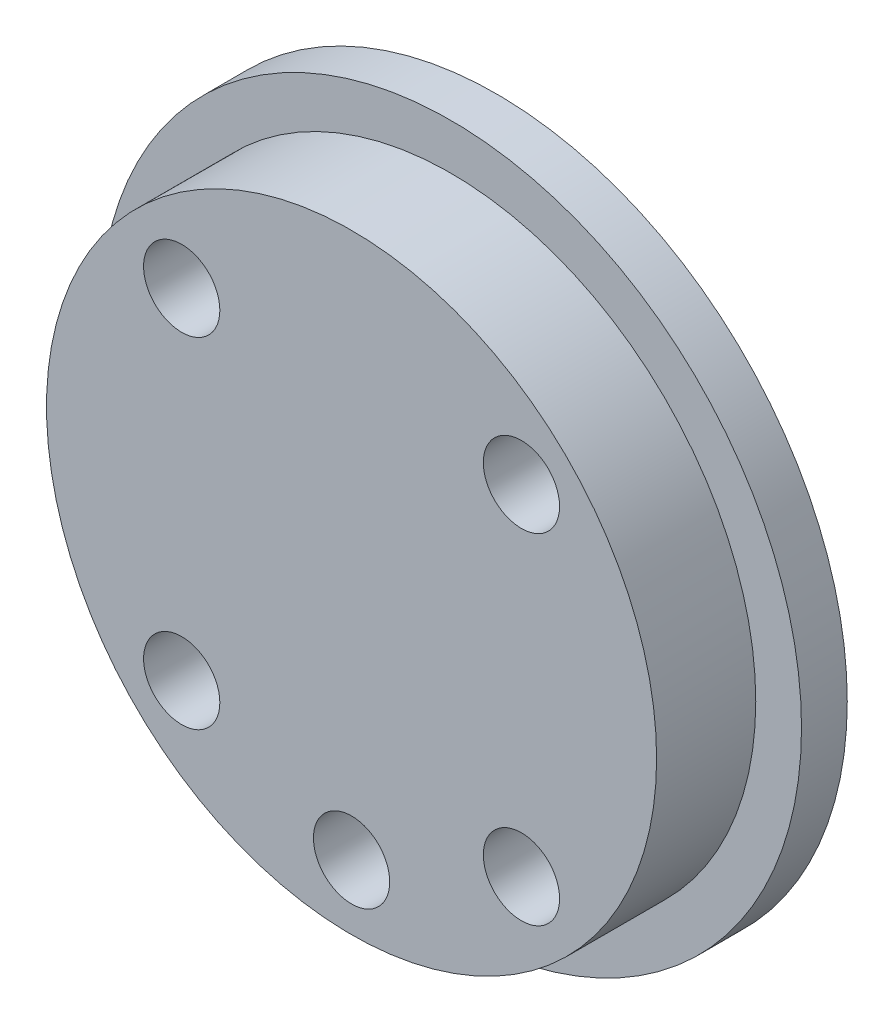
ISO-10303-21;
HEADER;
FILE_DESCRIPTION(('STEP AP214'),'2;1');
FILE_NAME('part.step','',(''),(''),'','','');
FILE_SCHEMA(('AUTOMOTIVE_DESIGN { 1 0 10303 214 1 1 1 1 }'));
ENDSEC;
DATA;
#1=APPLICATION_CONTEXT('core data for automotive mechanical design processes');
#2=APPLICATION_PROTOCOL_DEFINITION('international standard','automotive_design',2000,#1);
#3=PRODUCT_CONTEXT('',#1,'mechanical');
#4=PRODUCT('Part','Part','',(#3));
#5=PRODUCT_RELATED_PRODUCT_CATEGORY('part','',(#4));
#6=PRODUCT_DEFINITION_FORMATION('','',#4);
#7=PRODUCT_DEFINITION_CONTEXT('part definition',#1,'design');
#8=PRODUCT_DEFINITION('design','',#6,#7);
#9=PRODUCT_DEFINITION_SHAPE('','',#8);
#10=(LENGTH_UNIT() NAMED_UNIT(*) SI_UNIT(.MILLI.,.METRE.));
#11=(NAMED_UNIT(*) PLANE_ANGLE_UNIT() SI_UNIT($,.RADIAN.));
#12=(NAMED_UNIT(*) SI_UNIT($,.STERADIAN.) SOLID_ANGLE_UNIT());
#13=UNCERTAINTY_MEASURE_WITH_UNIT(LENGTH_MEASURE(1.E-05),#10,'distance_accuracy_value','');
#14=(GEOMETRIC_REPRESENTATION_CONTEXT(3) GLOBAL_UNCERTAINTY_ASSIGNED_CONTEXT((#13)) GLOBAL_UNIT_ASSIGNED_CONTEXT((#10,
#11,#12)) REPRESENTATION_CONTEXT('',''));
#15=CARTESIAN_POINT('',(0.,0.,0.));
#16=DIRECTION('',(0.,0.,1.));
#17=DIRECTION('',(1.,0.,0.));
#18=AXIS2_PLACEMENT_3D('',#15,#16,#17);
#19=CARTESIAN_POINT('',(49.,0.,999.5));
#20=DIRECTION('',(0.,0.,1.));
#21=DIRECTION('',(1.,0.,0.));
#22=AXIS2_PLACEMENT_3D('',#19,#20,#21);
#23=CYLINDRICAL_SURFACE('',#22,20.);
#24=CARTESIAN_POINT('',(49.,0.,999.5));
#25=DIRECTION('',(0.,0.,1.));
#26=DIRECTION('',(1.,0.,0.));
#27=AXIS2_PLACEMENT_3D('',#24,#25,#26);
#28=CIRCLE('',#27,20.);
#29=CARTESIAN_POINT('',(69.,0.,999.5));
#30=VERTEX_POINT('',#29);
#31=EDGE_CURVE('E22',#30,#30,#28,.T.);
#32=ORIENTED_EDGE('',*,*,#31,.T.);
#33=EDGE_LOOP('',(#32));
#34=FACE_BOUND('',#33,.T.);
#35=CARTESIAN_POINT('',(49.,0.,1006.));
#36=DIRECTION('',(0.,0.,1.));
#37=DIRECTION('',(1.,0.,0.));
#38=AXIS2_PLACEMENT_3D('',#35,#36,#37);
#39=CIRCLE('',#38,20.);
#40=CARTESIAN_POINT('',(69.,0.,1006.));
#41=VERTEX_POINT('',#40);
#42=EDGE_CURVE('E10',#41,#41,#39,.T.);
#43=ORIENTED_EDGE('',*,*,#42,.F.);
#44=EDGE_LOOP('',(#43));
#45=FACE_BOUND('',#44,.T.);
#46=ADVANCED_FACE('F15',(#34,#45),#23,.T.);
#47=CARTESIAN_POINT('',(49.,0.,1006.));
#48=DIRECTION('',(0.,0.,1.));
#49=DIRECTION('',(1.,0.,0.));
#50=AXIS2_PLACEMENT_3D('',#47,#48,#49);
#51=PLANE('',#50);
#52=CARTESIAN_POINT('',(49.,-15.75,1006.));
#53=DIRECTION('',(0.,0.,1.));
#54=DIRECTION('',(1.,0.,0.));
#55=AXIS2_PLACEMENT_3D('',#52,#53,#54);
#56=CIRCLE('',#55,2.5);
#57=CARTESIAN_POINT('',(51.5,-15.75,1006.));
#58=VERTEX_POINT('',#57);
#59=EDGE_CURVE('E77',#58,#58,#56,.T.);
#60=ORIENTED_EDGE('',*,*,#59,.F.);
#61=EDGE_LOOP('',(#60));
#62=FACE_BOUND('',#61,.T.);
#63=CARTESIAN_POINT('',(60.1369318036881,11.1369318036881,1006.));
#64=DIRECTION('',(0.,0.,1.));
#65=DIRECTION('',(1.,0.,0.));
#66=AXIS2_PLACEMENT_3D('',#63,#64,#65);
#67=CIRCLE('',#66,2.5);
#68=CARTESIAN_POINT('',(62.6369318036881,11.1369318036881,1006.));
#69=VERTEX_POINT('',#68);
#70=EDGE_CURVE('E53',#69,#69,#67,.T.);
#71=ORIENTED_EDGE('',*,*,#70,.F.);
#72=EDGE_LOOP('',(#71));
#73=FACE_BOUND('',#72,.T.);
#74=CARTESIAN_POINT('',(60.1369318036881,-11.1369318036881,1006.));
#75=DIRECTION('',(0.,0.,1.));
#76=DIRECTION('',(1.,0.,0.));
#77=AXIS2_PLACEMENT_3D('',#74,#75,#76);
#78=CIRCLE('',#77,2.5);
#79=CARTESIAN_POINT('',(62.6369318036881,-11.1369318036881,1006.));
#80=VERTEX_POINT('',#79);
#81=EDGE_CURVE('E62',#80,#80,#78,.T.);
#82=ORIENTED_EDGE('',*,*,#81,.F.);
#83=EDGE_LOOP('',(#82));
#84=FACE_BOUND('',#83,.T.);
#85=CARTESIAN_POINT('',(37.8630681963119,-11.1369318036881,1006.));
#86=DIRECTION('',(0.,0.,1.));
#87=DIRECTION('',(1.,0.,0.));
#88=AXIS2_PLACEMENT_3D('',#85,#86,#87);
#89=CIRCLE('',#88,2.5);
#90=CARTESIAN_POINT('',(40.3630681963119,-11.1369318036881,1006.));
#91=VERTEX_POINT('',#90);
#92=EDGE_CURVE('E70',#91,#91,#89,.T.);
#93=ORIENTED_EDGE('',*,*,#92,.F.);
#94=EDGE_LOOP('',(#93));
#95=FACE_BOUND('',#94,.T.);
#96=CARTESIAN_POINT('',(37.8630681963119,11.1369318036881,1006.));
#97=DIRECTION('',(0.,0.,1.));
#98=DIRECTION('',(1.,0.,0.));
#99=AXIS2_PLACEMENT_3D('',#96,#97,#98);
#100=CIRCLE('',#99,2.5);
#101=CARTESIAN_POINT('',(40.3630681963119,11.1369318036881,1006.));
#102=VERTEX_POINT('',#101);
#103=EDGE_CURVE('E45',#102,#102,#100,.T.);
#104=ORIENTED_EDGE('',*,*,#103,.F.);
#105=EDGE_LOOP('',(#104));
#106=FACE_BOUND('',#105,.T.);
#107=ORIENTED_EDGE('',*,*,#42,.T.);
#108=EDGE_LOOP('',(#107));
#109=FACE_BOUND('',#108,.T.);
#110=ADVANCED_FACE('F96',(#62,#73,#84,#95,#106,#109),#51,.T.);
#111=CARTESIAN_POINT('',(49.,0.,999.5));
#112=DIRECTION('',(0.,0.,-1.));
#113=DIRECTION('',(1.,0.,0.));
#114=AXIS2_PLACEMENT_3D('',#111,#112,#113);
#115=PLANE('',#114);
#116=ORIENTED_EDGE('',*,*,#31,.F.);
#117=EDGE_LOOP('',(#116));
#118=FACE_BOUND('',#117,.T.);
#119=CARTESIAN_POINT('',(49.,0.,999.5));
#120=DIRECTION('',(0.,0.,-1.));
#121=DIRECTION('',(-1.,0.,0.));
#122=AXIS2_PLACEMENT_3D('',#119,#120,#121);
#123=CIRCLE('',#122,23.);
#124=CARTESIAN_POINT('',(26.,0.,999.5));
#125=VERTEX_POINT('',#124);
#126=EDGE_CURVE('E38',#125,#125,#123,.T.);
#127=ORIENTED_EDGE('',*,*,#126,.F.);
#128=EDGE_LOOP('',(#127));
#129=FACE_BOUND('',#128,.T.);
#130=ADVANCED_FACE('F99',(#118,#129),#115,.F.);
#131=CARTESIAN_POINT('',(49.,0.,905.998));
#132=DIRECTION('',(0.,0.,1.));
#133=DIRECTION('',(1.,0.,0.));
#134=AXIS2_PLACEMENT_3D('',#131,#132,#133);
#135=CYLINDRICAL_SURFACE('',#134,23.);
#136=CARTESIAN_POINT('',(49.,0.,996.5));
#137=DIRECTION('',(0.,0.,1.));
#138=DIRECTION('',(1.,0.,0.));
#139=AXIS2_PLACEMENT_3D('',#136,#137,#138);
#140=CIRCLE('',#139,23.);
#141=CARTESIAN_POINT('',(72.,0.,996.5));
#142=VERTEX_POINT('',#141);
#143=EDGE_CURVE('E30',#142,#142,#140,.T.);
#144=ORIENTED_EDGE('',*,*,#143,.T.);
#145=EDGE_LOOP('',(#144));
#146=FACE_BOUND('',#145,.T.);
#147=ORIENTED_EDGE('',*,*,#126,.T.);
#148=EDGE_LOOP('',(#147));
#149=FACE_BOUND('',#148,.T.);
#150=ADVANCED_FACE('F122',(#146,#149),#135,.T.);
#151=CARTESIAN_POINT('',(49.,0.,996.5));
#152=DIRECTION('',(0.,0.,1.));
#153=DIRECTION('',(1.,0.,0.));
#154=AXIS2_PLACEMENT_3D('',#151,#152,#153);
#155=PLANE('',#154);
#156=ORIENTED_EDGE('',*,*,#143,.F.);
#157=EDGE_LOOP('',(#156));
#158=FACE_BOUND('',#157,.T.);
#159=ADVANCED_FACE('F111',(#158),#155,.F.);
#160=CARTESIAN_POINT('',(37.8630681963119,11.1369318036881,999.5));
#161=DIRECTION('',(0.,0.,1.));
#162=DIRECTION('',(1.,0.,0.));
#163=AXIS2_PLACEMENT_3D('',#160,#161,#162);
#164=CYLINDRICAL_SURFACE('',#163,2.5);
#165=CARTESIAN_POINT('',(37.8630681963119,11.1369318036881,999.5));
#166=DIRECTION('',(0.,0.,1.));
#167=DIRECTION('',(1.,0.,0.));
#168=AXIS2_PLACEMENT_3D('',#165,#166,#167);
#169=CIRCLE('',#168,2.5);
#170=CARTESIAN_POINT('',(40.3630681963119,11.1369318036881,999.5));
#171=VERTEX_POINT('',#170);
#172=EDGE_CURVE('E44',#171,#171,#169,.T.);
#173=ORIENTED_EDGE('',*,*,#172,.F.);
#174=EDGE_LOOP('',(#173));
#175=FACE_BOUND('',#174,.T.);
#176=ORIENTED_EDGE('',*,*,#103,.T.);
#177=EDGE_LOOP('',(#176));
#178=FACE_BOUND('',#177,.T.);
#179=ADVANCED_FACE('F108',(#175,#178),#164,.F.);
#180=CARTESIAN_POINT('',(49.,0.,999.5));
#181=DIRECTION('',(0.,0.,1.));
#182=DIRECTION('',(1.,0.,0.));
#183=AXIS2_PLACEMENT_3D('',#180,#181,#182);
#184=PLANE('',#183);
#185=ORIENTED_EDGE('',*,*,#172,.T.);
#186=EDGE_LOOP('',(#185));
#187=FACE_BOUND('',#186,.T.);
#188=ADVANCED_FACE('F110',(#187),#184,.T.);
#189=CARTESIAN_POINT('',(37.8630681963119,-11.1369318036881,999.5));
#190=DIRECTION('',(0.,0.,1.));
#191=DIRECTION('',(1.,0.,0.));
#192=AXIS2_PLACEMENT_3D('',#189,#190,#191);
#193=CYLINDRICAL_SURFACE('',#192,2.5);
#194=CARTESIAN_POINT('',(37.8630681963119,-11.1369318036881,999.5));
#195=DIRECTION('',(0.,0.,1.));
#196=DIRECTION('',(1.,0.,0.));
#197=AXIS2_PLACEMENT_3D('',#194,#195,#196);
#198=CIRCLE('',#197,2.5);
#199=CARTESIAN_POINT('',(40.3630681963119,-11.1369318036881,999.5));
#200=VERTEX_POINT('',#199);
#201=EDGE_CURVE('E49',#200,#200,#198,.T.);
#202=ORIENTED_EDGE('',*,*,#201,.F.);
#203=EDGE_LOOP('',(#202));
#204=FACE_BOUND('',#203,.T.);
#205=ORIENTED_EDGE('',*,*,#92,.T.);
#206=EDGE_LOOP('',(#205));
#207=FACE_BOUND('',#206,.T.);
#208=ADVANCED_FACE('F119',(#204,#207),#193,.F.);
#209=CARTESIAN_POINT('',(49.,0.,999.5));
#210=DIRECTION('',(0.,0.,1.));
#211=DIRECTION('',(1.,0.,0.));
#212=AXIS2_PLACEMENT_3D('',#209,#210,#211);
#213=PLANE('',#212);
#214=ORIENTED_EDGE('',*,*,#201,.T.);
#215=EDGE_LOOP('',(#214));
#216=FACE_BOUND('',#215,.T.);
#217=ADVANCED_FACE('F179',(#216),#213,.T.);
#218=CARTESIAN_POINT('',(60.1369318036881,-11.1369318036881,999.5));
#219=DIRECTION('',(0.,0.,1.));
#220=DIRECTION('',(1.,0.,0.));
#221=AXIS2_PLACEMENT_3D('',#218,#219,#220);
#222=CYLINDRICAL_SURFACE('',#221,2.5);
#223=CARTESIAN_POINT('',(60.1369318036881,-11.1369318036881,999.5));
#224=DIRECTION('',(0.,0.,1.));
#225=DIRECTION('',(1.,0.,0.));
#226=AXIS2_PLACEMENT_3D('',#223,#224,#225);
#227=CIRCLE('',#226,2.5);
#228=CARTESIAN_POINT('',(62.6369318036881,-11.1369318036881,999.5));
#229=VERTEX_POINT('',#228);
#230=EDGE_CURVE('E66',#229,#229,#227,.T.);
#231=ORIENTED_EDGE('',*,*,#230,.F.);
#232=EDGE_LOOP('',(#231));
#233=FACE_BOUND('',#232,.T.);
#234=ORIENTED_EDGE('',*,*,#81,.T.);
#235=EDGE_LOOP('',(#234));
#236=FACE_BOUND('',#235,.T.);
#237=ADVANCED_FACE('F190',(#233,#236),#222,.F.);
#238=CARTESIAN_POINT('',(49.,0.,999.5));
#239=DIRECTION('',(0.,0.,1.));
#240=DIRECTION('',(1.,0.,0.));
#241=AXIS2_PLACEMENT_3D('',#238,#239,#240);
#242=PLANE('',#241);
#243=ORIENTED_EDGE('',*,*,#230,.T.);
#244=EDGE_LOOP('',(#243));
#245=FACE_BOUND('',#244,.T.);
#246=ADVANCED_FACE('F201',(#245),#242,.T.);
#247=CARTESIAN_POINT('',(60.1369318036881,11.1369318036881,999.5));
#248=DIRECTION('',(0.,0.,1.));
#249=DIRECTION('',(1.,0.,0.));
#250=AXIS2_PLACEMENT_3D('',#247,#248,#249);
#251=CYLINDRICAL_SURFACE('',#250,2.5);
#252=CARTESIAN_POINT('',(60.1369318036881,11.1369318036881,999.5));
#253=DIRECTION('',(0.,0.,1.));
#254=DIRECTION('',(1.,0.,0.));
#255=AXIS2_PLACEMENT_3D('',#252,#253,#254);
#256=CIRCLE('',#255,2.5);
#257=CARTESIAN_POINT('',(62.6369318036881,11.1369318036881,999.5));
#258=VERTEX_POINT('',#257);
#259=EDGE_CURVE('E57',#258,#258,#256,.T.);
#260=ORIENTED_EDGE('',*,*,#259,.F.);
#261=EDGE_LOOP('',(#260));
#262=FACE_BOUND('',#261,.T.);
#263=ORIENTED_EDGE('',*,*,#70,.T.);
#264=EDGE_LOOP('',(#263));
#265=FACE_BOUND('',#264,.T.);
#266=ADVANCED_FACE('F212',(#262,#265),#251,.F.);
#267=CARTESIAN_POINT('',(49.,0.,999.5));
#268=DIRECTION('',(0.,0.,1.));
#269=DIRECTION('',(1.,0.,0.));
#270=AXIS2_PLACEMENT_3D('',#267,#268,#269);
#271=PLANE('',#270);
#272=ORIENTED_EDGE('',*,*,#259,.T.);
#273=EDGE_LOOP('',(#272));
#274=FACE_BOUND('',#273,.T.);
#275=ADVANCED_FACE('F92',(#274),#271,.T.);
#276=CARTESIAN_POINT('',(49.,-15.75,1000.));
#277=DIRECTION('',(0.,0.,1.));
#278=DIRECTION('',(1.,0.,0.));
#279=AXIS2_PLACEMENT_3D('',#276,#277,#278);
#280=CYLINDRICAL_SURFACE('',#279,2.5);
#281=CARTESIAN_POINT('',(49.,-15.75,1000.));
#282=DIRECTION('',(0.,0.,1.));
#283=DIRECTION('',(1.,0.,0.));
#284=AXIS2_PLACEMENT_3D('',#281,#282,#283);
#285=CIRCLE('',#284,2.5);
#286=CARTESIAN_POINT('',(51.5,-15.75,1000.));
#287=VERTEX_POINT('',#286);
#288=EDGE_CURVE('E58',#287,#287,#285,.T.);
#289=ORIENTED_EDGE('',*,*,#288,.F.);
#290=EDGE_LOOP('',(#289));
#291=FACE_BOUND('',#290,.T.);
#292=ORIENTED_EDGE('',*,*,#59,.T.);
#293=EDGE_LOOP('',(#292));
#294=FACE_BOUND('',#293,.T.);
#295=ADVANCED_FACE('F89',(#291,#294),#280,.F.);
#296=CARTESIAN_POINT('',(49.,0.,1000.));
#297=DIRECTION('',(0.,0.,1.));
#298=DIRECTION('',(1.,0.,0.));
#299=AXIS2_PLACEMENT_3D('',#296,#297,#298);
#300=PLANE('',#299);
#301=ORIENTED_EDGE('',*,*,#288,.T.);
#302=EDGE_LOOP('',(#301));
#303=FACE_BOUND('',#302,.T.);
#304=ADVANCED_FACE('F87',(#303),#300,.T.);
#305=CLOSED_SHELL('',(#46,#110,#130,#150,#159,#179,#188,#208,#217,#237,#246,#266,#275,#295,#304));
#306=MANIFOLD_SOLID_BREP('B1',#305);
#307=ADVANCED_BREP_SHAPE_REPRESENTATION('',(#18,#306),#14);
#308=SHAPE_DEFINITION_REPRESENTATION(#9,#307);
ENDSEC;
END-ISO-10303-21;
